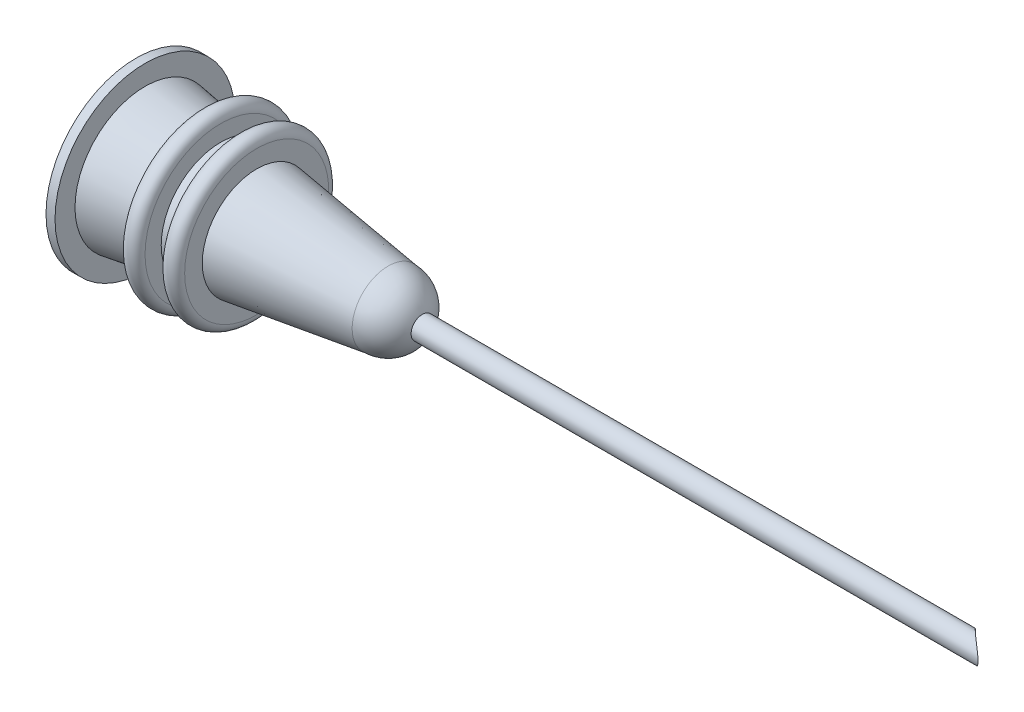
ISO-10303-21;
HEADER;
FILE_DESCRIPTION(('STEP AP214'),'2;1');
FILE_NAME('part.step','',(''),(''),'','','');
FILE_SCHEMA(('AUTOMOTIVE_DESIGN { 1 0 10303 214 1 1 1 1 }'));
ENDSEC;
DATA;
#1=APPLICATION_CONTEXT('core data for automotive mechanical design processes');
#2=APPLICATION_PROTOCOL_DEFINITION('international standard','automotive_design',2000,#1);
#3=PRODUCT_CONTEXT('',#1,'mechanical');
#4=PRODUCT('Part','Part','',(#3));
#5=PRODUCT_RELATED_PRODUCT_CATEGORY('part','',(#4));
#6=PRODUCT_DEFINITION_FORMATION('','',#4);
#7=PRODUCT_DEFINITION_CONTEXT('part definition',#1,'design');
#8=PRODUCT_DEFINITION('design','',#6,#7);
#9=PRODUCT_DEFINITION_SHAPE('','',#8);
#10=(LENGTH_UNIT() NAMED_UNIT(*) SI_UNIT(.MILLI.,.METRE.));
#11=(NAMED_UNIT(*) PLANE_ANGLE_UNIT() SI_UNIT($,.RADIAN.));
#12=(NAMED_UNIT(*) SI_UNIT($,.STERADIAN.) SOLID_ANGLE_UNIT());
#13=UNCERTAINTY_MEASURE_WITH_UNIT(LENGTH_MEASURE(1.E-05),#10,'distance_accuracy_value','');
#14=(GEOMETRIC_REPRESENTATION_CONTEXT(3) GLOBAL_UNCERTAINTY_ASSIGNED_CONTEXT((#13)) GLOBAL_UNIT_ASSIGNED_CONTEXT((#10,
#11,#12)) REPRESENTATION_CONTEXT('',''));
#15=CARTESIAN_POINT('',(0.,0.,0.));
#16=DIRECTION('',(0.,0.,1.));
#17=DIRECTION('',(1.,0.,0.));
#18=AXIS2_PLACEMENT_3D('',#15,#16,#17);
#19=CARTESIAN_POINT('',(0.,0.,0.));
#20=DIRECTION('',(0.,0.,1.));
#21=DIRECTION('',(1.,0.,0.));
#22=AXIS2_PLACEMENT_3D('',#19,#20,#21);
#23=SPHERICAL_SURFACE('',#22,2.);
#24=CARTESIAN_POINT('',(0.,0.,0.));
#25=DIRECTION('',(-1.,0.,0.));
#26=DIRECTION('',(0.,0.,1.));
#27=AXIS2_PLACEMENT_3D('',#24,#25,#26);
#28=SPHERICAL_SURFACE('',#27,2.);
#29=CARTESIAN_POINT('',(1.89983551919633,0.,0.));
#30=DIRECTION('',(-1.,0.,0.));
#31=DIRECTION('',(0.,0.,1.));
#32=AXIS2_PLACEMENT_3D('',#29,#30,#31);
#33=CIRCLE('',#32,0.625);
#34=CARTESIAN_POINT('',(1.89983551919633,0.,0.625));
#35=VERTEX_POINT('',#34);
#36=EDGE_CURVE('E97',#35,#35,#33,.T.);
#37=ORIENTED_EDGE('',*,*,#36,.T.);
#38=EDGE_LOOP('',(#37));
#39=FACE_BOUND('',#38,.T.);
#40=CARTESIAN_POINT('',(0.,0.,0.));
#41=DIRECTION('',(-1.,0.,0.));
#42=DIRECTION('',(0.,0.,1.));
#43=AXIS2_PLACEMENT_3D('',#40,#41,#42);
#44=CIRCLE('',#43,2.);
#45=CARTESIAN_POINT('',(0.,0.,2.));
#46=VERTEX_POINT('',#45);
#47=EDGE_CURVE('E11',#46,#46,#44,.T.);
#48=ORIENTED_EDGE('',*,*,#47,.F.);
#49=EDGE_LOOP('',(#48));
#50=FACE_BOUND('',#49,.T.);
#51=ADVANCED_FACE('F40',(#39,#50),#28,.T.);
#52=CARTESIAN_POINT('',(0.,0.,0.));
#53=DIRECTION('',(-1.,0.,0.));
#54=DIRECTION('',(0.,0.,1.));
#55=AXIS2_PLACEMENT_3D('',#52,#53,#54);
#56=CONICAL_SURFACE('',#55,2.,0.139085948398872);
#57=CARTESIAN_POINT('',(-7.3,0.,0.));
#58=DIRECTION('',(-1.,0.,0.));
#59=DIRECTION('',(0.,0.,1.));
#60=AXIS2_PLACEMENT_3D('',#57,#58,#59);
#61=CIRCLE('',#60,3.02192562078636);
#62=CARTESIAN_POINT('',(-7.3,0.,3.02192562078636));
#63=VERTEX_POINT('',#62);
#64=EDGE_CURVE('E52',#63,#63,#61,.T.);
#65=ORIENTED_EDGE('',*,*,#64,.F.);
#66=EDGE_LOOP('',(#65));
#67=FACE_BOUND('',#66,.T.);
#68=ORIENTED_EDGE('',*,*,#47,.T.);
#69=EDGE_LOOP('',(#68));
#70=FACE_BOUND('',#69,.T.);
#71=ADVANCED_FACE('F128',(#67,#70),#56,.T.);
#72=CARTESIAN_POINT('',(-7.3,4.,0.));
#73=DIRECTION('',(-1.,0.,0.));
#74=DIRECTION('',(0.,0.,1.));
#75=AXIS2_PLACEMENT_3D('',#72,#73,#74);
#76=PLANE('',#75);
#77=CARTESIAN_POINT('',(-7.3,0.,0.));
#78=DIRECTION('',(-1.,0.,0.));
#79=DIRECTION('',(0.,0.,1.));
#80=AXIS2_PLACEMENT_3D('',#77,#78,#79);
#81=CIRCLE('',#80,4.);
#82=CARTESIAN_POINT('',(-7.3,0.,4.));
#83=VERTEX_POINT('',#82);
#84=EDGE_CURVE('E56',#83,#83,#81,.T.);
#85=ORIENTED_EDGE('',*,*,#84,.F.);
#86=EDGE_LOOP('',(#85));
#87=FACE_BOUND('',#86,.T.);
#88=ORIENTED_EDGE('',*,*,#64,.T.);
#89=EDGE_LOOP('',(#88));
#90=FACE_BOUND('',#89,.T.);
#91=ADVANCED_FACE('F133',(#87,#90),#76,.F.);
#92=CARTESIAN_POINT('',(-7.8,0.,0.));
#93=DIRECTION('',(-1.,0.,0.));
#94=DIRECTION('',(0.,0.,1.));
#95=AXIS2_PLACEMENT_3D('',#92,#93,#94);
#96=TOROIDAL_SURFACE('',#95,4.,0.5);
#97=CARTESIAN_POINT('',(-8.3,0.,0.));
#98=DIRECTION('',(-1.,0.,0.));
#99=DIRECTION('',(0.,0.,1.));
#100=AXIS2_PLACEMENT_3D('',#97,#98,#99);
#101=CIRCLE('',#100,4.);
#102=CARTESIAN_POINT('',(-8.3,0.,4.));
#103=VERTEX_POINT('',#102);
#104=EDGE_CURVE('E61',#103,#103,#101,.T.);
#105=ORIENTED_EDGE('',*,*,#104,.F.);
#106=EDGE_LOOP('',(#105));
#107=FACE_BOUND('',#106,.T.);
#108=ORIENTED_EDGE('',*,*,#84,.T.);
#109=EDGE_LOOP('',(#108));
#110=FACE_BOUND('',#109,.T.);
#111=ADVANCED_FACE('F141',(#107,#110),#96,.T.);
#112=CARTESIAN_POINT('',(-8.3,4.,0.));
#113=DIRECTION('',(1.,0.,0.));
#114=DIRECTION('',(0.,0.,-1.));
#115=AXIS2_PLACEMENT_3D('',#112,#113,#114);
#116=PLANE('',#115);
#117=CARTESIAN_POINT('',(-8.3,0.,0.));
#118=DIRECTION('',(-1.,0.,0.));
#119=DIRECTION('',(0.,0.,1.));
#120=AXIS2_PLACEMENT_3D('',#117,#118,#119);
#121=CIRCLE('',#120,3.16191543185298);
#122=CARTESIAN_POINT('',(-8.3,0.,3.16191543185298));
#123=VERTEX_POINT('',#122);
#124=EDGE_CURVE('E64',#123,#123,#121,.T.);
#125=ORIENTED_EDGE('',*,*,#124,.F.);
#126=EDGE_LOOP('',(#125));
#127=FACE_BOUND('',#126,.T.);
#128=ORIENTED_EDGE('',*,*,#104,.T.);
#129=EDGE_LOOP('',(#128));
#130=FACE_BOUND('',#129,.T.);
#131=ADVANCED_FACE('F148',(#127,#130),#116,.F.);
#132=CARTESIAN_POINT('',(-8.3,0.,0.));
#133=DIRECTION('',(-1.,0.,0.));
#134=DIRECTION('',(0.,0.,1.));
#135=AXIS2_PLACEMENT_3D('',#132,#133,#134);
#136=CONICAL_SURFACE('',#135,3.16191543185298,0.139085948398873);
#137=CARTESIAN_POINT('',(-9.3,0.,0.));
#138=DIRECTION('',(-1.,0.,0.));
#139=DIRECTION('',(0.,0.,1.));
#140=AXIS2_PLACEMENT_3D('',#137,#138,#139);
#141=CIRCLE('',#140,3.3019052429196);
#142=CARTESIAN_POINT('',(-9.3,0.,3.3019052429196));
#143=VERTEX_POINT('',#142);
#144=EDGE_CURVE('E67',#143,#143,#141,.T.);
#145=ORIENTED_EDGE('',*,*,#144,.F.);
#146=EDGE_LOOP('',(#145));
#147=FACE_BOUND('',#146,.T.);
#148=ORIENTED_EDGE('',*,*,#124,.T.);
#149=EDGE_LOOP('',(#148));
#150=FACE_BOUND('',#149,.T.);
#151=ADVANCED_FACE('F152',(#147,#150),#136,.T.);
#152=CARTESIAN_POINT('',(-9.3,4.2,0.));
#153=DIRECTION('',(-1.,0.,0.));
#154=DIRECTION('',(0.,0.,1.));
#155=AXIS2_PLACEMENT_3D('',#152,#153,#154);
#156=PLANE('',#155);
#157=CARTESIAN_POINT('',(-9.3,0.,0.));
#158=DIRECTION('',(-1.,0.,0.));
#159=DIRECTION('',(0.,0.,1.));
#160=AXIS2_PLACEMENT_3D('',#157,#158,#159);
#161=CIRCLE('',#160,4.2);
#162=CARTESIAN_POINT('',(-9.3,0.,4.2));
#163=VERTEX_POINT('',#162);
#164=EDGE_CURVE('E70',#163,#163,#161,.T.);
#165=ORIENTED_EDGE('',*,*,#164,.F.);
#166=EDGE_LOOP('',(#165));
#167=FACE_BOUND('',#166,.T.);
#168=ORIENTED_EDGE('',*,*,#144,.T.);
#169=EDGE_LOOP('',(#168));
#170=FACE_BOUND('',#169,.T.);
#171=ADVANCED_FACE('F155',(#167,#170),#156,.F.);
#172=CARTESIAN_POINT('',(-9.8,0.,0.));
#173=DIRECTION('',(-1.,0.,0.));
#174=DIRECTION('',(0.,0.,1.));
#175=AXIS2_PLACEMENT_3D('',#172,#173,#174);
#176=TOROIDAL_SURFACE('',#175,4.2,0.5);
#177=CARTESIAN_POINT('',(-10.3,0.,0.));
#178=DIRECTION('',(-1.,0.,0.));
#179=DIRECTION('',(0.,0.,1.));
#180=AXIS2_PLACEMENT_3D('',#177,#178,#179);
#181=CIRCLE('',#180,4.2);
#182=CARTESIAN_POINT('',(-10.3,0.,4.2));
#183=VERTEX_POINT('',#182);
#184=EDGE_CURVE('E73',#183,#183,#181,.T.);
#185=ORIENTED_EDGE('',*,*,#184,.F.);
#186=EDGE_LOOP('',(#185));
#187=FACE_BOUND('',#186,.T.);
#188=ORIENTED_EDGE('',*,*,#164,.T.);
#189=EDGE_LOOP('',(#188));
#190=FACE_BOUND('',#189,.T.);
#191=ADVANCED_FACE('F159',(#187,#190),#176,.T.);
#192=CARTESIAN_POINT('',(-10.3,4.2,0.));
#193=DIRECTION('',(1.,0.,0.));
#194=DIRECTION('',(0.,0.,-1.));
#195=AXIS2_PLACEMENT_3D('',#192,#193,#194);
#196=PLANE('',#195);
#197=CARTESIAN_POINT('',(-10.3,0.,0.));
#198=DIRECTION('',(-1.,0.,0.));
#199=DIRECTION('',(0.,0.,1.));
#200=AXIS2_PLACEMENT_3D('',#197,#198,#199);
#201=CIRCLE('',#200,3.44189505398623);
#202=CARTESIAN_POINT('',(-10.3,0.,3.44189505398623));
#203=VERTEX_POINT('',#202);
#204=EDGE_CURVE('E76',#203,#203,#201,.T.);
#205=ORIENTED_EDGE('',*,*,#204,.F.);
#206=EDGE_LOOP('',(#205));
#207=FACE_BOUND('',#206,.T.);
#208=ORIENTED_EDGE('',*,*,#184,.T.);
#209=EDGE_LOOP('',(#208));
#210=FACE_BOUND('',#209,.T.);
#211=ADVANCED_FACE('F163',(#207,#210),#196,.F.);
#212=CARTESIAN_POINT('',(-10.3,0.,0.));
#213=DIRECTION('',(-1.,0.,0.));
#214=DIRECTION('',(0.,0.,1.));
#215=AXIS2_PLACEMENT_3D('',#212,#213,#214);
#216=CONICAL_SURFACE('',#215,3.44189505398623,0.139085948398872);
#217=CARTESIAN_POINT('',(-13.5,0.,0.));
#218=DIRECTION('',(-1.,0.,0.));
#219=DIRECTION('',(0.,0.,1.));
#220=AXIS2_PLACEMENT_3D('',#217,#218,#219);
#221=CIRCLE('',#220,3.88986244939943);
#222=CARTESIAN_POINT('',(-13.5,0.,3.88986244939943));
#223=VERTEX_POINT('',#222);
#224=EDGE_CURVE('E79',#223,#223,#221,.T.);
#225=ORIENTED_EDGE('',*,*,#224,.F.);
#226=EDGE_LOOP('',(#225));
#227=FACE_BOUND('',#226,.T.);
#228=ORIENTED_EDGE('',*,*,#204,.T.);
#229=EDGE_LOOP('',(#228));
#230=FACE_BOUND('',#229,.T.);
#231=ADVANCED_FACE('F167',(#227,#230),#216,.T.);
#232=CARTESIAN_POINT('',(-13.5,3.88986244939943,0.));
#233=DIRECTION('',(-1.,0.,0.));
#234=DIRECTION('',(0.,0.,1.));
#235=AXIS2_PLACEMENT_3D('',#232,#233,#234);
#236=PLANE('',#235);
#237=CARTESIAN_POINT('',(-13.5,0.,0.));
#238=DIRECTION('',(-1.,0.,0.));
#239=DIRECTION('',(0.,0.,1.));
#240=AXIS2_PLACEMENT_3D('',#237,#238,#239);
#241=CIRCLE('',#240,5.);
#242=CARTESIAN_POINT('',(-13.5,0.,5.));
#243=VERTEX_POINT('',#242);
#244=EDGE_CURVE('E82',#243,#243,#241,.T.);
#245=ORIENTED_EDGE('',*,*,#244,.F.);
#246=EDGE_LOOP('',(#245));
#247=FACE_BOUND('',#246,.T.);
#248=ORIENTED_EDGE('',*,*,#224,.T.);
#249=EDGE_LOOP('',(#248));
#250=FACE_BOUND('',#249,.T.);
#251=ADVANCED_FACE('F171',(#247,#250),#236,.F.);
#252=CARTESIAN_POINT('',(-26.1796673082699,0.,0.));
#253=DIRECTION('',(-1.,0.,0.));
#254=DIRECTION('',(0.,0.,1.));
#255=AXIS2_PLACEMENT_3D('',#252,#253,#254);
#256=CYLINDRICAL_SURFACE('',#255,5.);
#257=CARTESIAN_POINT('',(-14.,0.,0.));
#258=DIRECTION('',(-1.,0.,0.));
#259=DIRECTION('',(0.,0.,1.));
#260=AXIS2_PLACEMENT_3D('',#257,#258,#259);
#261=CIRCLE('',#260,5.);
#262=CARTESIAN_POINT('',(-14.,0.,5.));
#263=VERTEX_POINT('',#262);
#264=EDGE_CURVE('E85',#263,#263,#261,.T.);
#265=ORIENTED_EDGE('',*,*,#264,.F.);
#266=EDGE_LOOP('',(#265));
#267=FACE_BOUND('',#266,.T.);
#268=ORIENTED_EDGE('',*,*,#244,.T.);
#269=EDGE_LOOP('',(#268));
#270=FACE_BOUND('',#269,.T.);
#271=ADVANCED_FACE('F175',(#267,#270),#256,.T.);
#272=CARTESIAN_POINT('',(-14.,3.20254408116583,0.));
#273=DIRECTION('',(1.,0.,0.));
#274=DIRECTION('',(0.,0.,-1.));
#275=AXIS2_PLACEMENT_3D('',#272,#273,#274);
#276=PLANE('',#275);
#277=CARTESIAN_POINT('',(-14.,0.,0.));
#278=DIRECTION('',(-1.,0.,0.));
#279=DIRECTION('',(0.,0.,1.));
#280=AXIS2_PLACEMENT_3D('',#277,#278,#279);
#281=CIRCLE('',#280,3.20254408116583);
#282=CARTESIAN_POINT('',(-14.,0.,3.20254408116583));
#283=VERTEX_POINT('',#282);
#284=EDGE_CURVE('E88',#283,#283,#281,.T.);
#285=ORIENTED_EDGE('',*,*,#284,.F.);
#286=EDGE_LOOP('',(#285));
#287=FACE_BOUND('',#286,.T.);
#288=ORIENTED_EDGE('',*,*,#264,.T.);
#289=EDGE_LOOP('',(#288));
#290=FACE_BOUND('',#289,.T.);
#291=ADVANCED_FACE('F178',(#287,#290),#276,.F.);
#292=CARTESIAN_POINT('',(-14.,0.,0.));
#293=DIRECTION('',(-1.,0.,0.));
#294=DIRECTION('',(0.,0.,1.));
#295=AXIS2_PLACEMENT_3D('',#292,#293,#294);
#296=CONICAL_SURFACE('',#295,3.20254408116583,0.139085948398873);
#297=CARTESIAN_POINT('',(-1.,0.,0.));
#298=DIRECTION('',(-1.,0.,0.));
#299=DIRECTION('',(0.,0.,1.));
#300=AXIS2_PLACEMENT_3D('',#297,#298,#299);
#301=CIRCLE('',#300,1.3826765372997);
#302=CARTESIAN_POINT('',(-1.,0.,1.3826765372997));
#303=VERTEX_POINT('',#302);
#304=EDGE_CURVE('E91',#303,#303,#301,.T.);
#305=ORIENTED_EDGE('',*,*,#304,.F.);
#306=EDGE_LOOP('',(#305));
#307=FACE_BOUND('',#306,.T.);
#308=ORIENTED_EDGE('',*,*,#284,.T.);
#309=EDGE_LOOP('',(#308));
#310=FACE_BOUND('',#309,.T.);
#311=ADVANCED_FACE('F182',(#307,#310),#296,.F.);
#312=CARTESIAN_POINT('',(-1.,0.,0.));
#313=DIRECTION('',(1.,0.,0.));
#314=DIRECTION('',(0.,0.,-1.));
#315=AXIS2_PLACEMENT_3D('',#312,#313,#314);
#316=PLANE('',#315);
#317=ORIENTED_EDGE('',*,*,#304,.T.);
#318=EDGE_LOOP('',(#317));
#319=FACE_BOUND('',#318,.T.);
#320=CARTESIAN_POINT('',(-1.,0.,0.));
#321=DIRECTION('',(-1.,0.,0.));
#322=DIRECTION('',(0.,0.,1.));
#323=AXIS2_PLACEMENT_3D('',#320,#321,#322);
#324=CIRCLE('',#323,0.5);
#325=CARTESIAN_POINT('',(-1.,0.,0.5));
#326=VERTEX_POINT('',#325);
#327=EDGE_CURVE('E94',#326,#326,#324,.T.);
#328=ORIENTED_EDGE('',*,*,#327,.F.);
#329=EDGE_LOOP('',(#328));
#330=FACE_BOUND('',#329,.T.);
#331=ADVANCED_FACE('F123',(#319,#330),#316,.F.);
#332=CARTESIAN_POINT('',(2.,0.,0.));
#333=DIRECTION('',(-1.,0.,0.));
#334=DIRECTION('',(0.,0.,1.));
#335=AXIS2_PLACEMENT_3D('',#332,#333,#334);
#336=CYLINDRICAL_SURFACE('',#335,0.5);
#337=CARTESIAN_POINT('',(33.2133572240247,0.,0.5));
#338=CARTESIAN_POINT('',(33.2133540873904,-0.0206911604771621,0.499997713902423));
#339=CARTESIAN_POINT('',(33.2116603768153,-0.0414156272767563,0.498699117848006));
#340=CARTESIAN_POINT('',(33.2050862336979,-0.0820610207915776,0.493648368370397));
#341=CARTESIAN_POINT('',(33.2001972332591,-0.101979633753154,0.489889618214948));
#342=CARTESIAN_POINT('',(33.1878189660875,-0.140198323254918,0.480342246968345));
#343=CARTESIAN_POINT('',(33.1803582511038,-0.15851351212902,0.474575907809434));
#344=CARTESIAN_POINT('',(33.1633969154665,-0.193512856864027,0.461414175636795));
#345=CARTESIAN_POINT('',(33.1538958791258,-0.210196679347086,0.454018450650317));
#346=CARTESIAN_POINT('',(33.1275236600257,-0.250890764056576,0.433393767943465));
#347=CARTESIAN_POINT('',(33.1095267199741,-0.273696096476687,0.41923398912829));
#348=CARTESIAN_POINT('',(33.0711120918595,-0.315510093852545,0.388748731034204));
#349=CARTESIAN_POINT('',(33.0506874628734,-0.334507434321163,0.372417025444559));
#350=CARTESIAN_POINT('',(32.9968116137514,-0.378430713381983,0.328934871252782));
#351=CARTESIAN_POINT('',(32.9622982140171,-0.400992094815009,0.300716980485339));
#352=CARTESIAN_POINT('',(32.8914818331232,-0.438977288582884,0.2419168119271));
#353=CARTESIAN_POINT('',(32.8551768265161,-0.454392807909138,0.211331834830839));
#354=CARTESIAN_POINT('',(32.7801768876947,-0.479148271154322,0.147141530567845));
#355=CARTESIAN_POINT('',(32.7414471727431,-0.488190241157371,0.113462485295819));
#356=CARTESIAN_POINT('',(32.6639900704748,-0.499179070986505,0.0449731215478539));
#357=CARTESIAN_POINT('',(32.6252626831393,-0.501126288923453,0.0101628602600487));
#358=CARTESIAN_POINT('',(32.5481897907993,-0.497617632098678,-0.060269792653692));
#359=CARTESIAN_POINT('',(32.5098514335999,-0.492091087419324,-0.095896761213501));
#360=CARTESIAN_POINT('',(32.4348555084819,-0.472805852817016,-0.166732061750347));
#361=CARTESIAN_POINT('',(32.398195996008,-0.459056960266577,-0.201940841182006));
#362=CARTESIAN_POINT('',(32.3386132992708,-0.427913191175785,-0.260038836233129));
#363=CARTESIAN_POINT('',(32.3149105961655,-0.412909065582733,-0.283410423703073));
#364=CARTESIAN_POINT('',(32.26961600011,-0.378008798296266,-0.328511906174412));
#365=CARTESIAN_POINT('',(32.2480210251697,-0.358119953624573,-0.350244187323489));
#366=CARTESIAN_POINT('',(32.2126529454101,-0.318479839081452,-0.38614209335917));
#367=CARTESIAN_POINT('',(32.198240738428,-0.299819660414859,-0.400878396467623));
#368=CARTESIAN_POINT('',(32.1717530473407,-0.259441354905108,-0.428113232975466));
#369=CARTESIAN_POINT('',(32.1596745816962,-0.237727191914226,-0.440614620109313));
#370=CARTESIAN_POINT('',(32.1404843875972,-0.195752085335198,-0.460561330472013));
#371=CARTESIAN_POINT('',(32.1328672063694,-0.175965356063411,-0.468514158523563));
#372=CARTESIAN_POINT('',(32.1200185972255,-0.13483283818776,-0.48196176628345));
#373=CARTESIAN_POINT('',(32.1147857858919,-0.113487961987456,-0.487457971295331));
#374=CARTESIAN_POINT('',(32.1070154070934,-0.0696505331873207,-0.495629157182794));
#375=CARTESIAN_POINT('',(32.1044929843014,-0.0471522602292091,-0.498288284916828));
#376=CARTESIAN_POINT('',(32.1023854740738,-0.00186697725862842,-0.500509549835677));
#377=CARTESIAN_POINT('',(32.1027995085195,0.0209199444017521,-0.500072612868376));
#378=CARTESIAN_POINT('',(32.1063550811305,0.0638906358884711,-0.496326575635562));
#379=CARTESIAN_POINT('',(32.1092412554978,0.0841204979367059,-0.493286391029177));
#380=CARTESIAN_POINT('',(32.1172269818198,0.123633990958171,-0.484894610829506));
#381=CARTESIAN_POINT('',(32.1223267444414,0.142917531675575,-0.479542795238647));
#382=CARTESIAN_POINT('',(32.1347421671683,0.180960707065276,-0.466556375422547));
#383=CARTESIAN_POINT('',(32.1421445499773,0.199661085910134,-0.458832616153014));
#384=CARTESIAN_POINT('',(32.1587386297723,0.235352843679815,-0.441591107390296));
#385=CARTESIAN_POINT('',(32.1679313159954,0.25234326985681,-0.432072366167483));
#386=CARTESIAN_POINT('',(32.1927570213459,0.292542191752827,-0.406492026086043));
#387=CARTESIAN_POINT('',(32.2093130147385,0.314615951232671,-0.389537624754171));
#388=CARTESIAN_POINT('',(32.2448434875429,0.354673647140546,-0.353464021858585));
#389=CARTESIAN_POINT('',(32.2638234480032,0.372648049268509,-0.334339925498029));
#390=CARTESIAN_POINT('',(32.3112239689925,0.410936913865859,-0.287023384917838));
#391=CARTESIAN_POINT('',(32.3404515271804,0.429456377234275,-0.258189950711372));
#392=CARTESIAN_POINT('',(32.4010042427862,0.459771012262469,-0.199275517897231));
#393=CARTESIAN_POINT('',(32.4323321339301,0.471557222543333,-0.169192913571488));
#394=CARTESIAN_POINT('',(32.5066653155575,0.491911602960594,-0.0988235631923774));
#395=CARTESIAN_POINT('',(32.5501610317056,0.498194358300927,-0.058393338832454));
#396=CARTESIAN_POINT('',(32.6381264921248,0.501136971133415,0.021829663860328));
#397=CARTESIAN_POINT('',(32.6825979565028,0.497778206101951,0.0616210591085815));
#398=CARTESIAN_POINT('',(32.7719238120563,0.481671956664716,0.140066095377495));
#399=CARTESIAN_POINT('',(32.8167752922671,0.468798615100764,0.178697190937244));
#400=CARTESIAN_POINT('',(32.904798337359,0.433152068752357,0.253141850040134));
#401=CARTESIAN_POINT('',(32.9479747667824,0.410410303808951,0.288963938377645));
#402=CARTESIAN_POINT('',(33.0108284874716,0.367091356723041,0.340263293264464));
#403=CARTESIAN_POINT('',(33.0319827032867,0.350554127142374,0.357366121887956));
#404=CARTESIAN_POINT('',(33.0725312021564,0.313987926498923,0.389884745527765));
#405=CARTESIAN_POINT('',(33.0919273639776,0.293962751389904,0.405302345203654));
#406=CARTESIAN_POINT('',(33.1239459598304,0.254983422074054,0.430575859601802));
#407=CARTESIAN_POINT('',(33.1371136344492,0.236789388995729,0.440904803403594));
#408=CARTESIAN_POINT('',(33.1610966602931,0.197990132961925,0.459632132835514));
#409=CARTESIAN_POINT('',(33.1719154072972,0.177388457896092,0.468033306402713));
#410=CARTESIAN_POINT('',(33.1880575926188,0.139254296659444,0.480527849152693));
#411=CARTESIAN_POINT('',(33.1940777748264,0.122199259398015,0.485172144062996));
#412=CARTESIAN_POINT('',(33.2038279325729,0.0870875926282841,0.492682152012588));
#413=CARTESIAN_POINT('',(33.20756370253,0.0690336249672536,0.495552365216826));
#414=CARTESIAN_POINT('',(33.2111098069275,0.0423442745348517,0.498275370634097));
#415=CARTESIAN_POINT('',(33.2119502269179,0.0339129252210223,0.498920389953318));
#416=CARTESIAN_POINT('',(33.2130746604791,0.0169896010796327,0.499783236203371));
#417=CARTESIAN_POINT('',(33.2133585122025,0.00849760933784042,0.500000938872623));
#418=CARTESIAN_POINT('',(33.2133572240247,0.,0.5));
#419=B_SPLINE_CURVE_WITH_KNOTS('',3,(#337,#338,#339,#340,#341,#342,#343,#344,#345,#346,#347,
#348,#349,#350,#351,#352,#353,#354,#355,#356,#357,#358,#359,#360,#361,#362,#363,#364,#365,#366,
#367,#368,#369,#370,#371,#372,#373,#374,#375,#376,#377,#378,#379,#380,#381,#382,#383,#384,#385,
#386,#387,#388,#389,#390,#391,#392,#393,#394,#395,#396,#397,#398,#399,#400,#401,#402,#403,#404,
#405,#406,#407,#408,#409,#410,#411,#412,#413,#414,#415,#416,#417,#418),.UNSPECIFIED.,.T.,.F.,(4,
2,2,2,2,2,2,2,2,2,2,2,2,2,2,2,2,2,2,2,2,2,2,2,2,2,2,2,2,2,2,2,2,2,2,2,2,2,2,2,4),(0.,
0.0620294882164284,0.124225989391969,0.185753098808861,0.247292755434184,0.343700729799651,
0.440391289174622,0.589469154868808,0.738719599849516,0.894553209582073,1.05037895343281,
1.20768849342449,1.36481096301425,1.47401453847615,1.58305596232707,1.66617768555868,
1.74919250165481,1.81685093064166,1.8844700538935,1.95246507443686,2.02043976259229,
2.08213825550488,2.14384262154795,2.2082304725806,2.27265400276241,2.36926634692303,
2.46610115157019,2.60048285872864,2.73504300215536,2.91326877738158,3.09183902583558,
3.2728146256295,3.45321783982687,3.5485162232515,3.64371153356668,3.71764045848697,
3.79146178408488,3.84727292946725,3.90294191605687,3.92840927190383,3.95388403243604),.UNSPECIFIED.);
#420=CARTESIAN_POINT('',(33.2133572240247,0.,0.5));
#421=VERTEX_POINT('',#420);
#422=EDGE_CURVE('E100',#421,#421,#419,.T.);
#423=ORIENTED_EDGE('',*,*,#422,.T.);
#424=EDGE_LOOP('',(#423));
#425=FACE_BOUND('',#424,.T.);
#426=ORIENTED_EDGE('',*,*,#327,.T.);
#427=EDGE_LOOP('',(#426));
#428=FACE_BOUND('',#427,.T.);
#429=ADVANCED_FACE('F106',(#425,#428),#336,.F.);
#430=CARTESIAN_POINT('',(39.,0.,0.));
#431=DIRECTION('',(-1.,0.,0.));
#432=DIRECTION('',(0.,0.,1.));
#433=AXIS2_PLACEMENT_3D('',#430,#431,#432);
#434=CYLINDRICAL_SURFACE('',#433,0.625);
#435=CARTESIAN_POINT('',(33.3800389741768,0.,0.625));
#436=CARTESIAN_POINT('',(33.3800345951677,-0.0255559224835483,0.624996982094344));
#437=CARTESIAN_POINT('',(33.3778696315236,-0.051151879855963,0.62341142742791));
#438=CARTESIAN_POINT('',(33.369484892628,-0.101318738000158,0.61725481899067));
#439=CARTESIAN_POINT('',(33.3632540897538,-0.12588665705774,0.612675645677915));
#440=CARTESIAN_POINT('',(33.3475301296925,-0.172970573042699,0.601072440216716));
#441=CARTESIAN_POINT('',(33.3380756175023,-0.195507050427568,0.594077357100961));
#442=CARTESIAN_POINT('',(33.316637750677,-0.238560760646702,0.578136418997789));
#443=CARTESIAN_POINT('',(33.3046538223189,-0.259077533820364,0.569190121420076));
#444=CARTESIAN_POINT('',(33.271041903123,-0.309771691189024,0.54395063459903));
#445=CARTESIAN_POINT('',(33.2479376846869,-0.33837206272399,0.526467113007133));
#446=CARTESIAN_POINT('',(33.198713954096,-0.390817251245181,0.488807706871144));
#447=CARTESIAN_POINT('',(33.1725854863579,-0.414647342556513,0.468623796771306));
#448=CARTESIAN_POINT('',(33.1030668346994,-0.470380910857684,0.41428330843912));
#449=CARTESIAN_POINT('',(33.0583037431381,-0.499178736023527,0.378703565836376));
#450=CARTESIAN_POINT('',(32.9666302004036,-0.547677053519342,0.304372527674157));
#451=CARTESIAN_POINT('',(32.9197172548907,-0.567366668594334,0.265617504765073));
#452=CARTESIAN_POINT('',(32.822920399197,-0.59896835284461,0.184011455061955));
#453=CARTESIAN_POINT('',(32.7729981137821,-0.610488144386161,0.141054435702016));
#454=CARTESIAN_POINT('',(32.6733629942245,-0.624284356375572,0.0534625867510547));
#455=CARTESIAN_POINT('',(32.6236501130053,-0.626562978827074,0.00882815941471031));
#456=CARTESIAN_POINT('',(32.5274924203579,-0.621447147303508,-0.0793563047924496));
#457=CARTESIAN_POINT('',(32.4809978037873,-0.61445240168215,-0.122873861952618));
#458=CARTESIAN_POINT('',(32.3902193353045,-0.590538477778947,-0.209537010049568));
#459=CARTESIAN_POINT('',(32.3459327992155,-0.573631684494194,-0.252682997114385));
#460=CARTESIAN_POINT('',(32.2736306632965,-0.535257853198834,-0.324432194568876));
#461=CARTESIAN_POINT('',(32.244663385637,-0.516598851046442,-0.353577153527752));
#462=CARTESIAN_POINT('',(32.1894142615305,-0.473195765514245,-0.409840573202294));
#463=CARTESIAN_POINT('',(32.1631285984942,-0.448460506075037,-0.436961898833353));
#464=CARTESIAN_POINT('',(32.1200023344969,-0.399015467880555,-0.481929116400429));
#465=CARTESIAN_POINT('',(32.1023829957241,-0.375621567399095,-0.500469879261623));
#466=CARTESIAN_POINT('',(32.070069224214,-0.325023964391942,-0.534709258011071));
#467=CARTESIAN_POINT('',(32.055371206845,-0.297825001640906,-0.550411354940423));
#468=CARTESIAN_POINT('',(32.0319385539707,-0.245021960272501,-0.575576513069823));
#469=CARTESIAN_POINT('',(32.0226101371184,-0.219974831090016,-0.58565081548768));
#470=CARTESIAN_POINT('',(32.0069308951181,-0.167938257581884,-0.602635108573762));
#471=CARTESIAN_POINT('',(32.0005784702059,-0.140949865816584,-0.609546799278319));
#472=CARTESIAN_POINT('',(31.9912086517872,-0.0855762385072137,-0.619756230373231));
#473=CARTESIAN_POINT('',(31.9882084387925,-0.0571845788425756,-0.623035352664391));
#474=CARTESIAN_POINT('',(31.9858129235878,-6.9279706459995E-05,-0.625652757353698));
#475=CARTESIAN_POINT('',(31.9864166884907,0.0286542719338565,-0.624992059571414));
#476=CARTESIAN_POINT('',(31.9909745945903,0.0829864266121758,-0.620014815512639));
#477=CARTESIAN_POINT('',(31.9946361630587,0.108650489094001,-0.616017531360331));
#478=CARTESIAN_POINT('',(32.0047189773838,0.158760724547726,-0.605043991615469));
#479=CARTESIAN_POINT('',(32.0111404341974,0.183206804261508,-0.598067508302767));
#480=CARTESIAN_POINT('',(32.0267570298262,0.231395129858489,-0.581172252603851));
#481=CARTESIAN_POINT('',(32.0360591956835,0.255062374076389,-0.571140249345543));
#482=CARTESIAN_POINT('',(32.0569190145282,0.300196020088444,-0.548765156082446));
#483=CARTESIAN_POINT('',(32.0684779145481,0.321661195007278,-0.536420788458534));
#484=CARTESIAN_POINT('',(32.0994202982763,0.371898752384822,-0.503582646242125));
#485=CARTESIAN_POINT('',(32.119909523992,0.3992867372795,-0.482006453996977));
#486=CARTESIAN_POINT('',(32.1639065378927,0.448914968709341,-0.436173204949116));
#487=CARTESIAN_POINT('',(32.1874208656515,0.471143761432536,-0.411910356523809));
#488=CARTESIAN_POINT('',(32.2458886032211,0.518124408290957,-0.352283450850187));
#489=CARTESIAN_POINT('',(32.2818246612623,0.540695789711922,-0.316168752835118));
#490=CARTESIAN_POINT('',(32.3563628437492,0.577494878814476,-0.242534780033295));
#491=CARTESIAN_POINT('',(32.3949684756524,0.591711367225691,-0.20501368823846));
#492=CARTESIAN_POINT('',(32.4869599368354,0.616124564758434,-0.117168355060924));
#493=CARTESIAN_POINT('',(32.5410009631675,0.623423976506394,-0.0667253553746976));
#494=CARTESIAN_POINT('',(32.6504597905381,0.626122466357672,0.0330548693169831));
#495=CARTESIAN_POINT('',(32.7058800306384,0.621498721223583,0.0823897909798617));
#496=CARTESIAN_POINT('',(32.8174854171433,0.600768312238424,0.179457353235018));
#497=CARTESIAN_POINT('',(32.8736693286156,0.584487473441312,0.227154048394952));
#498=CARTESIAN_POINT('',(32.9841943980659,0.539949307803517,0.318869675552298));
#499=CARTESIAN_POINT('',(33.0385404432632,0.511726975010583,0.362898907235762));
#500=CARTESIAN_POINT('',(33.1182872472491,0.458060259907354,0.426186991458322));
#501=CARTESIAN_POINT('',(33.145382069657,0.437442270449214,0.44743297132661));
#502=CARTESIAN_POINT('',(33.1974479943248,0.391874295922541,0.487839198823286));
#503=CARTESIAN_POINT('',(33.2224211608306,0.366928595064213,0.507001478971274));
#504=CARTESIAN_POINT('',(33.2636614412526,0.318469879564637,0.538361883509238));
#505=CARTESIAN_POINT('',(33.280614403844,0.295930415787983,0.551151090465225));
#506=CARTESIAN_POINT('',(33.3116017869531,0.247811549818006,0.57439086156793));
#507=CARTESIAN_POINT('',(33.3256408142832,0.222237048090725,0.584845119195829));
#508=CARTESIAN_POINT('',(33.3464766593701,0.175251204862333,0.600295277505443));
#509=CARTESIAN_POINT('',(33.3542073768143,0.1544913552394,0.60600365224566));
#510=CARTESIAN_POINT('',(33.3668563157901,0.111699865607779,0.615324415857364));
#511=CARTESIAN_POINT('',(33.3717815216126,0.089671535502587,0.618942010035881));
#512=CARTESIAN_POINT('',(33.3767232425051,0.0561984516759998,0.622568874056696));
#513=CARTESIAN_POINT('',(33.3779626437266,0.0450177545894107,0.623477803729702));
#514=CARTESIAN_POINT('',(33.3796215987929,0.0225606585470305,0.624694122827163));
#515=CARTESIAN_POINT('',(33.3800409077307,0.011284232012632,0.625001332557948));
#516=CARTESIAN_POINT('',(33.3800389741768,0.,0.625));
#517=B_SPLINE_CURVE_WITH_KNOTS('',3,(#435,#436,#437,#438,#439,#440,#441,#442,#443,#444,#445,
#446,#447,#448,#449,#450,#451,#452,#453,#454,#455,#456,#457,#458,#459,#460,#461,#462,#463,#464,
#465,#466,#467,#468,#469,#470,#471,#472,#473,#474,#475,#476,#477,#478,#479,#480,#481,#482,#483,
#484,#485,#486,#487,#488,#489,#490,#491,#492,#493,#494,#495,#496,#497,#498,#499,#500,#501,#502,
#503,#504,#505,#506,#507,#508,#509,#510,#511,#512,#513,#514,#515,#516),.UNSPECIFIED.,.T.,.F.,(4,
2,2,2,2,2,2,2,2,2,2,2,2,2,2,2,2,2,2,2,2,2,2,2,2,2,2,2,2,2,2,2,2,2,2,2,2,2,2,2,4),(0.,
0.0766078451880082,0.153424339457554,0.229350590568302,0.305294081831812,0.42673932805476,
0.548553878096343,0.739579449991361,0.930832564236991,1.13074044137213,1.33060068127201,
1.5221203560516,1.71340123753075,1.84836685255496,1.98313761731544,2.08675428609934,
2.1902430154053,2.27558097195706,2.36087300173514,2.44660018706452,2.53230518293758,
2.61064017139895,2.6889811486003,2.77067781581455,2.8524197556295,2.97306547137222,
3.09397652134805,3.26023516906164,3.42671656811779,3.64841698824761,3.87054210091605,
4.09605728006759,4.32091612411485,4.44106467150224,4.56109494977043,4.6537170002124,
4.74619148447299,4.81457128861587,4.88278010952218,4.91659624976112,4.95042248709009),.UNSPECIFIED.);
#518=CARTESIAN_POINT('',(33.3800389741768,0.,0.625));
#519=VERTEX_POINT('',#518);
#520=EDGE_CURVE('E43',#519,#519,#517,.T.);
#521=ORIENTED_EDGE('',*,*,#520,.F.);
#522=EDGE_LOOP('',(#521));
#523=FACE_BOUND('',#522,.T.);
#524=ORIENTED_EDGE('',*,*,#36,.F.);
#525=EDGE_LOOP('',(#524));
#526=FACE_BOUND('',#525,.T.);
#527=ADVANCED_FACE('F112',(#523,#526),#434,.T.);
#528=CARTESIAN_POINT('',(39.,-5.,-7.04259073989891));
#529=DIRECTION('',(0.,1.,0.));
#530=DIRECTION('',(0.,0.,1.));
#531=AXIS2_PLACEMENT_3D('',#528,#529,#530);
#532=CYLINDRICAL_SURFACE('',#531,9.50662451590235);
#533=ORIENTED_EDGE('',*,*,#520,.T.);
#534=EDGE_LOOP('',(#533));
#535=FACE_BOUND('',#534,.T.);
#536=ORIENTED_EDGE('',*,*,#422,.F.);
#537=EDGE_LOOP('',(#536));
#538=FACE_BOUND('',#537,.T.);
#539=ADVANCED_FACE('F109',(#535,#538),#532,.F.);
#540=CLOSED_SHELL('',(#51,#71,#91,#111,#131,#151,#171,#191,#211,#231,#251,#271,#291,#311,#331,
#429,#527,#539));
#541=MANIFOLD_SOLID_BREP('B2',#540);
#542=ADVANCED_BREP_SHAPE_REPRESENTATION('',(#18,#541),#14);
#543=SHAPE_DEFINITION_REPRESENTATION(#9,#542);
ENDSEC;
END-ISO-10303-21;
